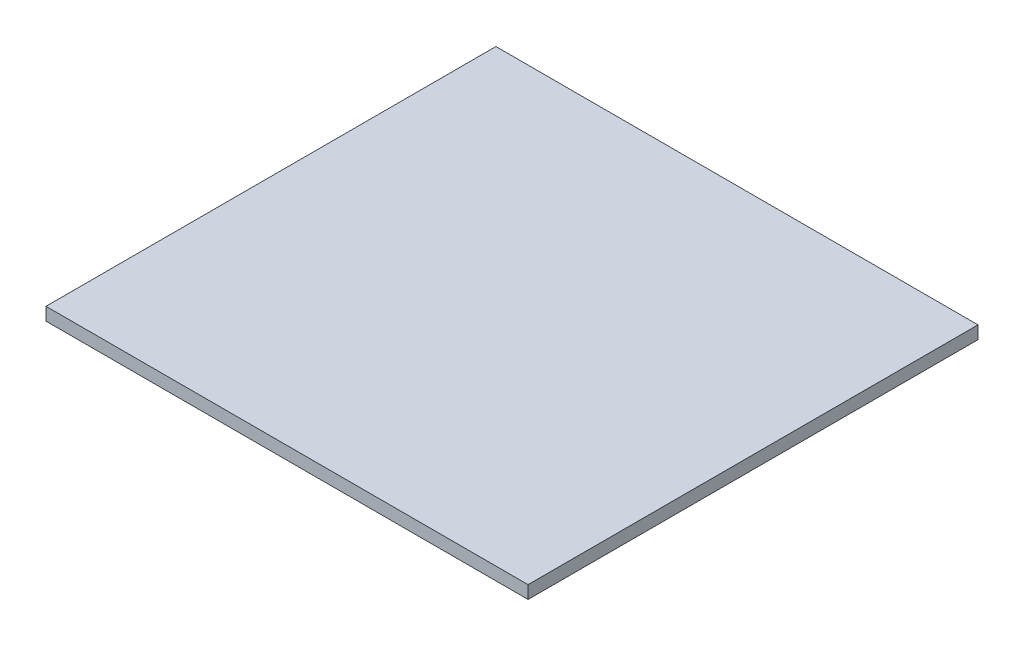
ISO-10303-21;
HEADER;
FILE_DESCRIPTION(('STEP AP214'),'2;1');
FILE_NAME('part.step','',(''),(''),'','','');
FILE_SCHEMA(('AUTOMOTIVE_DESIGN { 1 0 10303 214 1 1 1 1 }'));
ENDSEC;
DATA;
#1=APPLICATION_CONTEXT('core data for automotive mechanical design processes');
#2=APPLICATION_PROTOCOL_DEFINITION('international standard','automotive_design',2000,#1);
#3=PRODUCT_CONTEXT('',#1,'mechanical');
#4=PRODUCT('Part','Part','',(#3));
#5=PRODUCT_RELATED_PRODUCT_CATEGORY('part','',(#4));
#6=PRODUCT_DEFINITION_FORMATION('','',#4);
#7=PRODUCT_DEFINITION_CONTEXT('part definition',#1,'design');
#8=PRODUCT_DEFINITION('design','',#6,#7);
#9=PRODUCT_DEFINITION_SHAPE('','',#8);
#10=(LENGTH_UNIT() NAMED_UNIT(*) SI_UNIT(.MILLI.,.METRE.));
#11=(NAMED_UNIT(*) PLANE_ANGLE_UNIT() SI_UNIT($,.RADIAN.));
#12=(NAMED_UNIT(*) SI_UNIT($,.STERADIAN.) SOLID_ANGLE_UNIT());
#13=UNCERTAINTY_MEASURE_WITH_UNIT(LENGTH_MEASURE(1.E-05),#10,'distance_accuracy_value','');
#14=(GEOMETRIC_REPRESENTATION_CONTEXT(3) GLOBAL_UNCERTAINTY_ASSIGNED_CONTEXT((#13)) GLOBAL_UNIT_ASSIGNED_CONTEXT((#10,
#11,#12)) REPRESENTATION_CONTEXT('',''));
#15=CARTESIAN_POINT('',(0.,0.,0.));
#16=DIRECTION('',(0.,0.,1.));
#17=DIRECTION('',(1.,0.,0.));
#18=AXIS2_PLACEMENT_3D('',#15,#16,#17);
#19=CARTESIAN_POINT('',(-13.3544303797468,47.99,-47.8481012658228));
#20=DIRECTION('',(1.,0.,0.));
#21=DIRECTION('',(0.,0.,-1.));
#22=AXIS2_PLACEMENT_3D('',#19,#20,#21);
#23=PLANE('',#22);
#24=DIRECTION('',(0.,-1.,0.));
#25=VECTOR('',#24,1.);
#26=CARTESIAN_POINT('',(-13.3544303797468,50.,22.1518987341772));
#27=LINE('',#26,#25);
#28=CARTESIAN_POINT('',(-13.3544303797468,50.,22.1518987341772));
#29=VERTEX_POINT('',#28);
#30=CARTESIAN_POINT('',(-13.3544303797468,48.,22.1518987341772));
#31=VERTEX_POINT('',#30);
#32=EDGE_CURVE('E101',#29,#31,#27,.T.);
#33=ORIENTED_EDGE('',*,*,#32,.F.);
#34=DIRECTION('',(0.,0.,-1.));
#35=VECTOR('',#34,1.);
#36=CARTESIAN_POINT('',(-13.3544303797468,50.,0.));
#37=LINE('',#36,#35);
#38=CARTESIAN_POINT('',(-13.3544303797468,50.,-47.8481012658228));
#39=VERTEX_POINT('',#38);
#40=EDGE_CURVE('E11',#29,#39,#37,.T.);
#41=ORIENTED_EDGE('',*,*,#40,.T.);
#42=DIRECTION('',(0.,1.,0.));
#43=VECTOR('',#42,1.);
#44=CARTESIAN_POINT('',(-13.3544303797468,47.99,-47.8481012658228));
#45=LINE('',#44,#43);
#46=CARTESIAN_POINT('',(-13.3544303797468,48.,-47.8481012658228));
#47=VERTEX_POINT('',#46);
#48=EDGE_CURVE('E99',#47,#39,#45,.T.);
#49=ORIENTED_EDGE('',*,*,#48,.F.);
#50=DIRECTION('',(0.,0.,-1.));
#51=VECTOR('',#50,1.);
#52=CARTESIAN_POINT('',(-13.3544303797468,48.,0.));
#53=LINE('',#52,#51);
#54=EDGE_CURVE('E35',#31,#47,#53,.T.);
#55=ORIENTED_EDGE('',*,*,#54,.F.);
#56=EDGE_LOOP('',(#33,#41,#49,#55));
#57=FACE_BOUND('',#56,.T.);
#58=ADVANCED_FACE('F32',(#57),#23,.F.);
#59=CARTESIAN_POINT('',(-98.3544303797468,50.,22.1518987341772));
#60=DIRECTION('',(0.,0.,-1.));
#61=DIRECTION('',(-1.,0.,0.));
#62=AXIS2_PLACEMENT_3D('',#59,#60,#61);
#63=PLANE('',#62);
#64=DIRECTION('',(1.,0.,0.));
#65=VECTOR('',#64,1.);
#66=CARTESIAN_POINT('',(-98.3544303797468,50.,22.1518987341772));
#67=LINE('',#66,#65);
#68=CARTESIAN_POINT('',(61.6455696202532,50.,22.1518987341772));
#69=VERTEX_POINT('',#68);
#70=EDGE_CURVE('E69',#29,#69,#67,.T.);
#71=ORIENTED_EDGE('',*,*,#70,.F.);
#72=ORIENTED_EDGE('',*,*,#32,.T.);
#73=DIRECTION('',(1.,0.,0.));
#74=VECTOR('',#73,1.);
#75=CARTESIAN_POINT('',(-98.3544303797468,48.,22.1518987341772));
#76=LINE('',#75,#74);
#77=CARTESIAN_POINT('',(61.6455696202532,48.,22.1518987341772));
#78=VERTEX_POINT('',#77);
#79=EDGE_CURVE('E81',#31,#78,#76,.T.);
#80=ORIENTED_EDGE('',*,*,#79,.T.);
#81=DIRECTION('',(0.,-1.,0.));
#82=VECTOR('',#81,1.);
#83=CARTESIAN_POINT('',(61.6455696202532,50.,22.1518987341772));
#84=LINE('',#83,#82);
#85=EDGE_CURVE('E78',#69,#78,#84,.T.);
#86=ORIENTED_EDGE('',*,*,#85,.F.);
#87=EDGE_LOOP('',(#71,#72,#80,#86));
#88=FACE_BOUND('',#87,.T.);
#89=ADVANCED_FACE('F79',(#88),#63,.F.);
#90=CARTESIAN_POINT('',(61.6455696202532,50.,-47.8481012658228));
#91=DIRECTION('',(-1.,0.,0.));
#92=DIRECTION('',(0.,0.,1.));
#93=AXIS2_PLACEMENT_3D('',#90,#91,#92);
#94=PLANE('',#93);
#95=ORIENTED_EDGE('',*,*,#85,.T.);
#96=DIRECTION('',(0.,0.,-1.));
#97=VECTOR('',#96,1.);
#98=CARTESIAN_POINT('',(61.6455696202532,48.,-47.8481012658228));
#99=LINE('',#98,#97);
#100=CARTESIAN_POINT('',(61.6455696202532,48.,-47.8481012658228));
#101=VERTEX_POINT('',#100);
#102=EDGE_CURVE('E97',#78,#101,#99,.T.);
#103=ORIENTED_EDGE('',*,*,#102,.T.);
#104=DIRECTION('',(0.,-1.,0.));
#105=VECTOR('',#104,1.);
#106=CARTESIAN_POINT('',(61.6455696202532,50.,-47.8481012658228));
#107=LINE('',#106,#105);
#108=CARTESIAN_POINT('',(61.6455696202532,50.,-47.8481012658228));
#109=VERTEX_POINT('',#108);
#110=EDGE_CURVE('E85',#109,#101,#107,.T.);
#111=ORIENTED_EDGE('',*,*,#110,.F.);
#112=DIRECTION('',(0.,0.,-1.));
#113=VECTOR('',#112,1.);
#114=CARTESIAN_POINT('',(61.6455696202532,50.,-47.8481012658228));
#115=LINE('',#114,#113);
#116=EDGE_CURVE('E73',#69,#109,#115,.T.);
#117=ORIENTED_EDGE('',*,*,#116,.F.);
#118=EDGE_LOOP('',(#95,#103,#111,#117));
#119=FACE_BOUND('',#118,.T.);
#120=ADVANCED_FACE('F87',(#119),#94,.F.);
#121=CARTESIAN_POINT('',(0.,50.,0.));
#122=DIRECTION('',(0.,1.,0.));
#123=DIRECTION('',(0.,0.,1.));
#124=AXIS2_PLACEMENT_3D('',#121,#122,#123);
#125=PLANE('',#124);
#126=ORIENTED_EDGE('',*,*,#40,.F.);
#127=ORIENTED_EDGE('',*,*,#70,.T.);
#128=ORIENTED_EDGE('',*,*,#116,.T.);
#129=DIRECTION('',(-1.,0.,0.));
#130=VECTOR('',#129,1.);
#131=CARTESIAN_POINT('',(-98.3544303797468,50.,-47.8481012658228));
#132=LINE('',#131,#130);
#133=EDGE_CURVE('E90',#109,#39,#132,.T.);
#134=ORIENTED_EDGE('',*,*,#133,.T.);
#135=EDGE_LOOP('',(#126,#127,#128,#134));
#136=FACE_BOUND('',#135,.T.);
#137=ADVANCED_FACE('F71',(#136),#125,.T.);
#138=CARTESIAN_POINT('',(0.,48.,0.));
#139=DIRECTION('',(0.,1.,0.));
#140=DIRECTION('',(0.,0.,1.));
#141=AXIS2_PLACEMENT_3D('',#138,#139,#140);
#142=PLANE('',#141);
#143=ORIENTED_EDGE('',*,*,#79,.F.);
#144=ORIENTED_EDGE('',*,*,#54,.T.);
#145=DIRECTION('',(-1.,0.,0.));
#146=VECTOR('',#145,1.);
#147=CARTESIAN_POINT('',(-98.3544303797468,48.,-47.8481012658228));
#148=LINE('',#147,#146);
#149=EDGE_CURVE('E84',#101,#47,#148,.T.);
#150=ORIENTED_EDGE('',*,*,#149,.F.);
#151=ORIENTED_EDGE('',*,*,#102,.F.);
#152=EDGE_LOOP('',(#143,#144,#150,#151));
#153=FACE_BOUND('',#152,.T.);
#154=ADVANCED_FACE('F106',(#153),#142,.F.);
#155=CARTESIAN_POINT('',(-98.3544303797468,50.,-47.8481012658228));
#156=DIRECTION('',(0.,0.,1.));
#157=DIRECTION('',(1.,0.,0.));
#158=AXIS2_PLACEMENT_3D('',#155,#156,#157);
#159=PLANE('',#158);
#160=ORIENTED_EDGE('',*,*,#149,.T.);
#161=ORIENTED_EDGE('',*,*,#48,.T.);
#162=ORIENTED_EDGE('',*,*,#133,.F.);
#163=ORIENTED_EDGE('',*,*,#110,.T.);
#164=EDGE_LOOP('',(#160,#161,#162,#163));
#165=FACE_BOUND('',#164,.T.);
#166=ADVANCED_FACE('F103',(#165),#159,.F.);
#167=CLOSED_SHELL('',(#58,#89,#120,#137,#154,#166));
#168=MANIFOLD_SOLID_BREP('B2',#167);
#169=ADVANCED_BREP_SHAPE_REPRESENTATION('',(#18,#168),#14);
#170=SHAPE_DEFINITION_REPRESENTATION(#9,#169);
ENDSEC;
END-ISO-10303-21;
